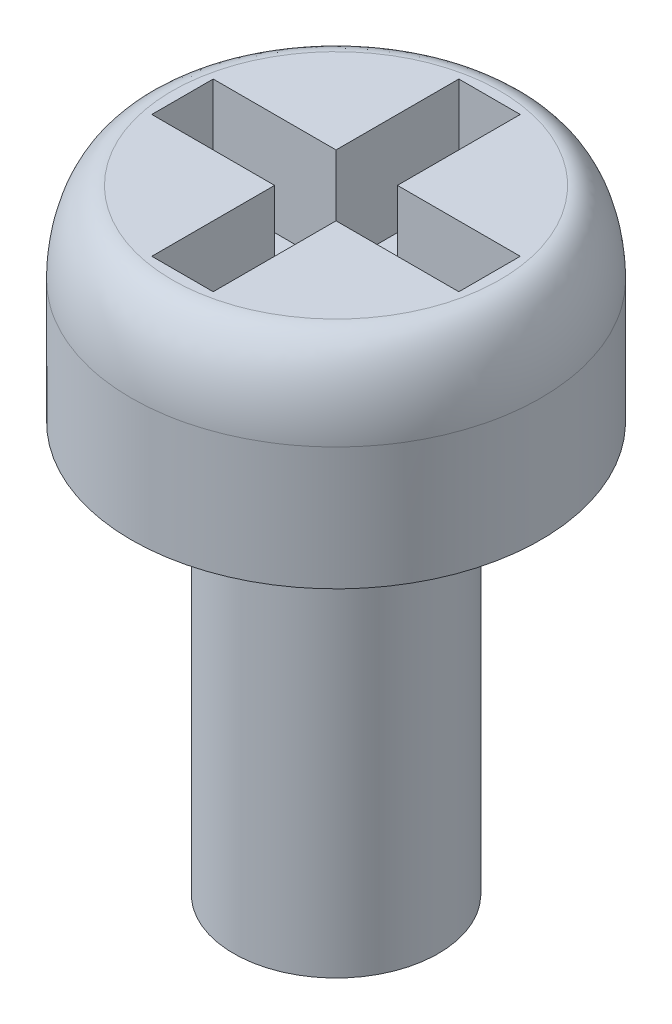
ISO-10303-21;
HEADER;
FILE_DESCRIPTION(('STEP AP214'),'2;1');
FILE_NAME('part.step','',(''),(''),'','','');
FILE_SCHEMA(('AUTOMOTIVE_DESIGN { 1 0 10303 214 1 1 1 1 }'));
ENDSEC;
DATA;
#1=APPLICATION_CONTEXT('core data for automotive mechanical design processes');
#2=APPLICATION_PROTOCOL_DEFINITION('international standard','automotive_design',2000,#1);
#3=PRODUCT_CONTEXT('',#1,'mechanical');
#4=PRODUCT('Part','Part','',(#3));
#5=PRODUCT_RELATED_PRODUCT_CATEGORY('part','',(#4));
#6=PRODUCT_DEFINITION_FORMATION('','',#4);
#7=PRODUCT_DEFINITION_CONTEXT('part definition',#1,'design');
#8=PRODUCT_DEFINITION('design','',#6,#7);
#9=PRODUCT_DEFINITION_SHAPE('','',#8);
#10=(LENGTH_UNIT() NAMED_UNIT(*) SI_UNIT(.MILLI.,.METRE.));
#11=(NAMED_UNIT(*) PLANE_ANGLE_UNIT() SI_UNIT($,.RADIAN.));
#12=(NAMED_UNIT(*) SI_UNIT($,.STERADIAN.) SOLID_ANGLE_UNIT());
#13=UNCERTAINTY_MEASURE_WITH_UNIT(LENGTH_MEASURE(1.E-05),#10,'distance_accuracy_value','');
#14=(GEOMETRIC_REPRESENTATION_CONTEXT(3) GLOBAL_UNCERTAINTY_ASSIGNED_CONTEXT((#13)) GLOBAL_UNIT_ASSIGNED_CONTEXT((#10,
#11,#12)) REPRESENTATION_CONTEXT('',''));
#15=CARTESIAN_POINT('',(0.,0.,0.));
#16=DIRECTION('',(0.,0.,1.));
#17=DIRECTION('',(1.,0.,0.));
#18=AXIS2_PLACEMENT_3D('',#15,#16,#17);
#19=CARTESIAN_POINT('',(0.,3.,0.));
#20=DIRECTION('',(0.,-1.,0.));
#21=DIRECTION('',(0.,0.,-1.));
#22=AXIS2_PLACEMENT_3D('',#19,#20,#21);
#23=CYLINDRICAL_SURFACE('',#22,3.);
#24=CARTESIAN_POINT('',(0.,1.8,3.));
#25=CARTESIAN_POINT('',(0.392699070335841,1.8,3.));
#26=CARTESIAN_POINT('',(0.785243663575687,1.8,2.9219180256566));
#27=CARTESIAN_POINT('',(1.51085693061485,1.8,2.62135916941112));
#28=CARTESIAN_POINT('',(1.84364016795948,1.8,2.3990005191598));
#29=CARTESIAN_POINT('',(2.3990005191598,1.8,1.84364016795948));
#30=CARTESIAN_POINT('',(2.62135916941112,1.8,1.51085693061486));
#31=CARTESIAN_POINT('',(2.9219180256566,1.8,0.785243663575675));
#32=CARTESIAN_POINT('',(3.,1.8,0.392699070335904));
#33=CARTESIAN_POINT('',(3.,1.8,-0.392699070335904));
#34=CARTESIAN_POINT('',(2.92191802565659,1.8,-0.785243663575702));
#35=CARTESIAN_POINT('',(2.62135916941113,1.8,-1.51085693061484));
#36=CARTESIAN_POINT('',(2.39900051915983,1.8,-1.84364016795946));
#37=CARTESIAN_POINT('',(1.84364016795945,1.8,-2.39900051915983));
#38=CARTESIAN_POINT('',(1.51085693061487,1.8,-2.62135916941112));
#39=CARTESIAN_POINT('',(0.785243663575681,1.8,-2.9219180256566));
#40=CARTESIAN_POINT('',(0.392699070335904,1.8,-3.));
#41=CARTESIAN_POINT('',(-0.392699070335903,1.8,-3.));
#42=CARTESIAN_POINT('',(-0.785243663575726,1.8,-2.92191802565658));
#43=CARTESIAN_POINT('',(-1.51085693061481,1.8,-2.62135916941114));
#44=CARTESIAN_POINT('',(-1.84364016795952,1.8,-2.39900051915976));
#45=CARTESIAN_POINT('',(-2.39900051915976,1.8,-1.84364016795952));
#46=CARTESIAN_POINT('',(-2.62135916941112,1.8,-1.51085693061486));
#47=CARTESIAN_POINT('',(-2.9219180256566,1.8,-0.785243663575691));
#48=CARTESIAN_POINT('',(-3.,1.8,-0.392699070335899));
#49=CARTESIAN_POINT('',(-3.,1.8,0.392699070335909));
#50=CARTESIAN_POINT('',(-2.9219180256566,1.8,0.785243663575677));
#51=CARTESIAN_POINT('',(-2.62135916941113,1.8,1.51085693061485));
#52=CARTESIAN_POINT('',(-2.39900051915983,1.8,1.84364016795946));
#53=CARTESIAN_POINT('',(-1.84364016795947,1.8,2.39900051915982));
#54=CARTESIAN_POINT('',(-1.51085693061486,1.8,2.62135916941112));
#55=CARTESIAN_POINT('',(-0.785243663575691,1.8,2.9219180256566));
#56=CARTESIAN_POINT('',(-0.392699070335841,1.8,3.));
#57=CARTESIAN_POINT('',(0.,1.8,3.));
#58=(BOUNDED_CURVE() B_SPLINE_CURVE(3,(#24,#25,#26,#27,#28,#29,#30,#31,#32,#33,#34,#35,#36,#37,
#38,#39,#40,#41,#42,#43,#44,#45,#46,#47,#48,#49,#50,#51,#52,#53,#54,#55,#56,#57),.UNSPECIFIED.,
.T.,.F.) B_SPLINE_CURVE_WITH_KNOTS((4,2,2,2,2,2,2,2,2,2,2,2,2,2,2,2,4),(0.,0.392699081698724,
0.785398163397448,1.17809724509617,1.5707963267949,1.96349540849362,2.35619449019234,
2.74889357189107,3.14159265358979,3.53429173528852,3.92699081698724,4.31968989868597,
4.71238898038469,5.10508806208341,5.49778714378214,5.89048622548086,6.28318530717959),
.UNSPECIFIED.) CURVE() GEOMETRIC_REPRESENTATION_ITEM() RATIONAL_B_SPLINE_CURVE((1.,1.,1.,1.,1.,
1.,1.,1.,1.,1.,1.,1.,1.,1.,1.,1.,1.,1.,1.,1.,1.,1.,1.,1.,1.,1.,1.,1.,1.,1.,1.,1.,1.,1.)) REPRESENTATION_ITEM(''));
#59=CARTESIAN_POINT('',(0.,1.8,3.));
#60=VERTEX_POINT('',#59);
#61=EDGE_CURVE('E12',#60,#60,#58,.F.);
#62=ORIENTED_EDGE('',*,*,#61,.T.);
#63=EDGE_LOOP('',(#62));
#64=FACE_BOUND('',#63,.T.);
#65=CARTESIAN_POINT('',(0.,0.,0.));
#66=DIRECTION('',(0.,1.,0.));
#67=DIRECTION('',(0.,0.,1.));
#68=AXIS2_PLACEMENT_3D('',#65,#66,#67);
#69=CIRCLE('',#68,3.);
#70=CARTESIAN_POINT('',(0.,0.,3.));
#71=VERTEX_POINT('',#70);
#72=EDGE_CURVE('E228',#71,#71,#69,.T.);
#73=ORIENTED_EDGE('',*,*,#72,.T.);
#74=EDGE_LOOP('',(#73));
#75=FACE_BOUND('',#74,.T.);
#76=ADVANCED_FACE('F46',(#64,#75),#23,.T.);
#77=CARTESIAN_POINT('',(0.,3.,0.));
#78=DIRECTION('',(0.,1.,0.));
#79=DIRECTION('',(0.,0.,1.));
#80=AXIS2_PLACEMENT_3D('',#77,#78,#79);
#81=PLANE('',#80);
#82=CARTESIAN_POINT('',(0.,3.,2.4));
#83=CARTESIAN_POINT('',(-0.314159256268673,3.,2.4));
#84=CARTESIAN_POINT('',(-0.628194930860573,3.,2.33753442052533));
#85=CARTESIAN_POINT('',(-1.20868554449186,3.,2.09708733552884));
#86=CARTESIAN_POINT('',(-1.47491213436758,3.,1.91920041532785));
#87=CARTESIAN_POINT('',(-1.91920041532786,3.,1.47491213436757));
#88=CARTESIAN_POINT('',(-2.09708733552891,3.,1.20868554449187));
#89=CARTESIAN_POINT('',(-2.33753442052527,3.,0.628194930860549));
#90=CARTESIAN_POINT('',(-2.4,3.,0.314159256268727));
#91=CARTESIAN_POINT('',(-2.4,3.,-0.314159256268719));
#92=CARTESIAN_POINT('',(-2.33753442052533,3.,-0.62819493086059));
#93=CARTESIAN_POINT('',(-2.09708733552884,3.,-1.20868554449185));
#94=CARTESIAN_POINT('',(-1.91920041532783,3.,-1.47491213436757));
#95=CARTESIAN_POINT('',(-1.47491213436761,3.,-1.91920041532786));
#96=CARTESIAN_POINT('',(-1.20868554449186,3.,-2.0970873355289));
#97=CARTESIAN_POINT('',(-0.62819493086057,3.,-2.33753442052528));
#98=CARTESIAN_POINT('',(-0.314159256268723,3.,-2.4));
#99=CARTESIAN_POINT('',(0.314159256268723,3.,-2.4));
#100=CARTESIAN_POINT('',(0.628194930860559,3.,-2.33753442052527));
#101=CARTESIAN_POINT('',(1.20868554449188,3.,-2.0970873355289));
#102=CARTESIAN_POINT('',(1.47491213436757,3.,-1.91920041532783));
#103=CARTESIAN_POINT('',(1.91920041532786,3.,-1.47491213436761));
#104=CARTESIAN_POINT('',(2.0970873355289,3.,-1.20868554449186));
#105=CARTESIAN_POINT('',(2.33753442052527,3.,-0.628194930860574));
#106=CARTESIAN_POINT('',(2.4,3.,-0.314159256268723));
#107=CARTESIAN_POINT('',(2.4,3.,0.314159256268723));
#108=CARTESIAN_POINT('',(2.33753442052528,3.,0.628194930860572));
#109=CARTESIAN_POINT('',(2.0970873355289,3.,1.20868554449186));
#110=CARTESIAN_POINT('',(1.91920041532785,3.,1.47491213436761));
#111=CARTESIAN_POINT('',(1.47491213436758,3.,1.91920041532782));
#112=CARTESIAN_POINT('',(1.20868554449186,3.,2.09708733552889));
#113=CARTESIAN_POINT('',(0.628194930860568,3.,2.33753442052529));
#114=CARTESIAN_POINT('',(0.314159256268672,3.,2.4));
#115=CARTESIAN_POINT('',(0.,3.,2.4));
#116=(BOUNDED_CURVE() B_SPLINE_CURVE(3,(#82,#83,#84,#85,#86,#87,#88,#89,#90,#91,#92,#93,#94,#95,
#96,#97,#98,#99,#100,#101,#102,#103,#104,#105,#106,#107,#108,#109,#110,#111,#112,#113,#114,
#115),.UNSPECIFIED.,.T.,.F.) B_SPLINE_CURVE_WITH_KNOTS((4,2,2,2,2,2,2,2,2,2,2,2,2,2,2,2,4),(0.,
0.392699081698725,0.785398163397448,1.17809724509617,1.5707963267949,1.96349540849362,
2.35619449019234,2.74889357189107,3.14159265358979,3.53429173528852,3.92699081698724,
4.31968989868597,4.71238898038469,5.10508806208341,5.49778714378214,5.89048622548086,
6.28318530717959),
.UNSPECIFIED.) CURVE() GEOMETRIC_REPRESENTATION_ITEM() RATIONAL_B_SPLINE_CURVE((1.,1.,1.,1.,1.,
1.,1.,1.,1.,1.,1.,1.,1.,1.,1.,1.,1.,1.,1.,1.,1.,1.,1.,1.,1.,1.,1.,1.,1.,1.,1.,1.,1.,1.)) REPRESENTATION_ITEM(''));
#117=CARTESIAN_POINT('',(0.,3.,2.4));
#118=VERTEX_POINT('',#117);
#119=EDGE_CURVE('E60',#118,#118,#116,.F.);
#120=ORIENTED_EDGE('',*,*,#119,.T.);
#121=EDGE_LOOP('',(#120));
#122=FACE_BOUND('',#121,.T.);
#123=DIRECTION('',(0.,0.,-1.));
#124=VECTOR('',#123,1.);
#125=CARTESIAN_POINT('',(0.45,3.,2.25));
#126=LINE('',#125,#124);
#127=CARTESIAN_POINT('',(0.45,3.,2.25));
#128=VERTEX_POINT('',#127);
#129=CARTESIAN_POINT('',(0.45,3.,0.45));
#130=VERTEX_POINT('',#129);
#131=EDGE_CURVE('E67',#128,#130,#126,.T.);
#132=ORIENTED_EDGE('',*,*,#131,.F.);
#133=DIRECTION('',(1.,0.,0.));
#134=VECTOR('',#133,1.);
#135=CARTESIAN_POINT('',(-0.45,3.,2.25));
#136=LINE('',#135,#134);
#137=CARTESIAN_POINT('',(-0.45,3.,2.25));
#138=VERTEX_POINT('',#137);
#139=EDGE_CURVE('E204',#138,#128,#136,.T.);
#140=ORIENTED_EDGE('',*,*,#139,.F.);
#141=DIRECTION('',(0.,0.,1.));
#142=VECTOR('',#141,1.);
#143=CARTESIAN_POINT('',(-0.45,3.,2.25));
#144=LINE('',#143,#142);
#145=CARTESIAN_POINT('',(-0.45,3.,0.45));
#146=VERTEX_POINT('',#145);
#147=EDGE_CURVE('E202',#146,#138,#144,.T.);
#148=ORIENTED_EDGE('',*,*,#147,.F.);
#149=DIRECTION('',(1.,0.,0.));
#150=VECTOR('',#149,1.);
#151=CARTESIAN_POINT('',(-2.25,3.,0.45));
#152=LINE('',#151,#150);
#153=CARTESIAN_POINT('',(-2.25,3.,0.45));
#154=VERTEX_POINT('',#153);
#155=EDGE_CURVE('E151',#154,#146,#152,.T.);
#156=ORIENTED_EDGE('',*,*,#155,.F.);
#157=DIRECTION('',(0.,0.,1.));
#158=VECTOR('',#157,1.);
#159=CARTESIAN_POINT('',(-2.25,3.,-0.45));
#160=LINE('',#159,#158);
#161=CARTESIAN_POINT('',(-2.25,3.,-0.45));
#162=VERTEX_POINT('',#161);
#163=EDGE_CURVE('E198',#162,#154,#160,.T.);
#164=ORIENTED_EDGE('',*,*,#163,.F.);
#165=DIRECTION('',(-1.,0.,0.));
#166=VECTOR('',#165,1.);
#167=CARTESIAN_POINT('',(-2.25,3.,-0.45));
#168=LINE('',#167,#166);
#169=CARTESIAN_POINT('',(-0.45,3.,-0.45));
#170=VERTEX_POINT('',#169);
#171=EDGE_CURVE('E195',#170,#162,#168,.T.);
#172=ORIENTED_EDGE('',*,*,#171,.F.);
#173=DIRECTION('',(0.,0.,1.));
#174=VECTOR('',#173,1.);
#175=CARTESIAN_POINT('',(-0.45,3.,-2.25));
#176=LINE('',#175,#174);
#177=CARTESIAN_POINT('',(-0.45,3.,-2.25));
#178=VERTEX_POINT('',#177);
#179=EDGE_CURVE('E192',#178,#170,#176,.T.);
#180=ORIENTED_EDGE('',*,*,#179,.F.);
#181=DIRECTION('',(-1.,0.,0.));
#182=VECTOR('',#181,1.);
#183=CARTESIAN_POINT('',(-0.45,3.,-2.25));
#184=LINE('',#183,#182);
#185=CARTESIAN_POINT('',(0.45,3.,-2.25));
#186=VERTEX_POINT('',#185);
#187=EDGE_CURVE('E189',#186,#178,#184,.T.);
#188=ORIENTED_EDGE('',*,*,#187,.F.);
#189=DIRECTION('',(0.,0.,-1.));
#190=VECTOR('',#189,1.);
#191=CARTESIAN_POINT('',(0.45,3.,-2.25));
#192=LINE('',#191,#190);
#193=CARTESIAN_POINT('',(0.45,3.,-0.45));
#194=VERTEX_POINT('',#193);
#195=EDGE_CURVE('E186',#194,#186,#192,.T.);
#196=ORIENTED_EDGE('',*,*,#195,.F.);
#197=DIRECTION('',(-1.,0.,0.));
#198=VECTOR('',#197,1.);
#199=CARTESIAN_POINT('',(0.45,3.,-0.45));
#200=LINE('',#199,#198);
#201=CARTESIAN_POINT('',(2.25,3.,-0.45));
#202=VERTEX_POINT('',#201);
#203=EDGE_CURVE('E183',#202,#194,#200,.T.);
#204=ORIENTED_EDGE('',*,*,#203,.F.);
#205=DIRECTION('',(0.,0.,-1.));
#206=VECTOR('',#205,1.);
#207=CARTESIAN_POINT('',(2.25,3.,-0.45));
#208=LINE('',#207,#206);
#209=CARTESIAN_POINT('',(2.25,3.,0.45));
#210=VERTEX_POINT('',#209);
#211=EDGE_CURVE('E180',#210,#202,#208,.T.);
#212=ORIENTED_EDGE('',*,*,#211,.F.);
#213=DIRECTION('',(1.,0.,0.));
#214=VECTOR('',#213,1.);
#215=CARTESIAN_POINT('',(0.45,3.,0.45));
#216=LINE('',#215,#214);
#217=EDGE_CURVE('E177',#130,#210,#216,.T.);
#218=ORIENTED_EDGE('',*,*,#217,.F.);
#219=EDGE_LOOP('',(#132,#140,#148,#156,#164,#172,#180,#188,#196,#204,#212,#218));
#220=FACE_BOUND('',#219,.T.);
#221=ADVANCED_FACE('F243',(#122,#220),#81,.T.);
#222=CARTESIAN_POINT('',(0.,0.,0.));
#223=DIRECTION('',(0.,1.,0.));
#224=DIRECTION('',(0.,0.,1.));
#225=AXIS2_PLACEMENT_3D('',#222,#223,#224);
#226=PLANE('',#225);
#227=CARTESIAN_POINT('',(0.,0.,0.));
#228=DIRECTION('',(0.,-1.,0.));
#229=DIRECTION('',(0.,0.,-1.));
#230=AXIS2_PLACEMENT_3D('',#227,#228,#229);
#231=CIRCLE('',#230,1.5);
#232=CARTESIAN_POINT('',(0.,0.,-1.5));
#233=VERTEX_POINT('',#232);
#234=EDGE_CURVE('E229',#233,#233,#231,.T.);
#235=ORIENTED_EDGE('',*,*,#234,.F.);
#236=EDGE_LOOP('',(#235));
#237=FACE_BOUND('',#236,.T.);
#238=ORIENTED_EDGE('',*,*,#72,.F.);
#239=EDGE_LOOP('',(#238));
#240=FACE_BOUND('',#239,.T.);
#241=ADVANCED_FACE('F253',(#237,#240),#226,.F.);
#242=CARTESIAN_POINT('',(0.,-6.,0.));
#243=DIRECTION('',(0.,1.,0.));
#244=DIRECTION('',(0.,0.,1.));
#245=AXIS2_PLACEMENT_3D('',#242,#243,#244);
#246=CYLINDRICAL_SURFACE('',#245,1.5);
#247=CARTESIAN_POINT('',(0.,-6.,0.));
#248=DIRECTION('',(0.,-1.,0.));
#249=DIRECTION('',(0.,0.,-1.));
#250=AXIS2_PLACEMENT_3D('',#247,#248,#249);
#251=CIRCLE('',#250,1.5);
#252=CARTESIAN_POINT('',(0.,-6.,-1.5));
#253=VERTEX_POINT('',#252);
#254=EDGE_CURVE('E208',#253,#253,#251,.T.);
#255=ORIENTED_EDGE('',*,*,#254,.F.);
#256=EDGE_LOOP('',(#255));
#257=FACE_BOUND('',#256,.T.);
#258=ORIENTED_EDGE('',*,*,#234,.T.);
#259=EDGE_LOOP('',(#258));
#260=FACE_BOUND('',#259,.T.);
#261=ADVANCED_FACE('F254',(#257,#260),#246,.T.);
#262=CARTESIAN_POINT('',(0.,-6.,0.));
#263=DIRECTION('',(0.,-1.,0.));
#264=DIRECTION('',(0.,0.,-1.));
#265=AXIS2_PLACEMENT_3D('',#262,#263,#264);
#266=PLANE('',#265);
#267=ORIENTED_EDGE('',*,*,#254,.T.);
#268=EDGE_LOOP('',(#267));
#269=FACE_BOUND('',#268,.T.);
#270=ADVANCED_FACE('F332',(#269),#266,.T.);
#271=CARTESIAN_POINT('',(0.45,1.5,2.25));
#272=DIRECTION('',(1.,0.,0.));
#273=DIRECTION('',(0.,0.,-1.));
#274=AXIS2_PLACEMENT_3D('',#271,#272,#273);
#275=PLANE('',#274);
#276=ORIENTED_EDGE('',*,*,#131,.T.);
#277=DIRECTION('',(0.,1.,0.));
#278=VECTOR('',#277,1.);
#279=CARTESIAN_POINT('',(0.45,1.5,0.45));
#280=LINE('',#279,#278);
#281=CARTESIAN_POINT('',(0.45,1.5,0.45));
#282=VERTEX_POINT('',#281);
#283=EDGE_CURVE('E115',#282,#130,#280,.T.);
#284=ORIENTED_EDGE('',*,*,#283,.F.);
#285=DIRECTION('',(0.,0.,-1.));
#286=VECTOR('',#285,1.);
#287=CARTESIAN_POINT('',(0.45,1.5,2.25));
#288=LINE('',#287,#286);
#289=CARTESIAN_POINT('',(0.45,1.5,2.25));
#290=VERTEX_POINT('',#289);
#291=EDGE_CURVE('E206',#290,#282,#288,.T.);
#292=ORIENTED_EDGE('',*,*,#291,.F.);
#293=DIRECTION('',(0.,1.,0.));
#294=VECTOR('',#293,1.);
#295=CARTESIAN_POINT('',(0.45,1.5,2.25));
#296=LINE('',#295,#294);
#297=EDGE_CURVE('E75',#290,#128,#296,.T.);
#298=ORIENTED_EDGE('',*,*,#297,.T.);
#299=EDGE_LOOP('',(#276,#284,#292,#298));
#300=FACE_BOUND('',#299,.T.);
#301=ADVANCED_FACE('F299',(#300),#275,.F.);
#302=CARTESIAN_POINT('',(-0.45,1.5,2.25));
#303=DIRECTION('',(0.,0.,1.));
#304=DIRECTION('',(1.,0.,0.));
#305=AXIS2_PLACEMENT_3D('',#302,#303,#304);
#306=PLANE('',#305);
#307=ORIENTED_EDGE('',*,*,#139,.T.);
#308=ORIENTED_EDGE('',*,*,#297,.F.);
#309=DIRECTION('',(1.,0.,0.));
#310=VECTOR('',#309,1.);
#311=CARTESIAN_POINT('',(-0.45,1.5,2.25));
#312=LINE('',#311,#310);
#313=CARTESIAN_POINT('',(-0.45,1.5,2.25));
#314=VERTEX_POINT('',#313);
#315=EDGE_CURVE('E163',#314,#290,#312,.T.);
#316=ORIENTED_EDGE('',*,*,#315,.F.);
#317=DIRECTION('',(0.,1.,0.));
#318=VECTOR('',#317,1.);
#319=CARTESIAN_POINT('',(-0.45,1.5,2.25));
#320=LINE('',#319,#318);
#321=EDGE_CURVE('E155',#314,#138,#320,.T.);
#322=ORIENTED_EDGE('',*,*,#321,.T.);
#323=EDGE_LOOP('',(#307,#308,#316,#322));
#324=FACE_BOUND('',#323,.T.);
#325=ADVANCED_FACE('F296',(#324),#306,.F.);
#326=CARTESIAN_POINT('',(-0.45,1.5,2.25));
#327=DIRECTION('',(-1.,0.,0.));
#328=DIRECTION('',(0.,0.,1.));
#329=AXIS2_PLACEMENT_3D('',#326,#327,#328);
#330=PLANE('',#329);
#331=ORIENTED_EDGE('',*,*,#147,.T.);
#332=ORIENTED_EDGE('',*,*,#321,.F.);
#333=DIRECTION('',(0.,0.,1.));
#334=VECTOR('',#333,1.);
#335=CARTESIAN_POINT('',(-0.45,1.5,2.25));
#336=LINE('',#335,#334);
#337=CARTESIAN_POINT('',(-0.45,1.5,0.45));
#338=VERTEX_POINT('',#337);
#339=EDGE_CURVE('E159',#338,#314,#336,.T.);
#340=ORIENTED_EDGE('',*,*,#339,.F.);
#341=DIRECTION('',(0.,1.,0.));
#342=VECTOR('',#341,1.);
#343=CARTESIAN_POINT('',(-0.45,1.5,0.45));
#344=LINE('',#343,#342);
#345=EDGE_CURVE('E144',#338,#146,#344,.T.);
#346=ORIENTED_EDGE('',*,*,#345,.T.);
#347=EDGE_LOOP('',(#331,#332,#340,#346));
#348=FACE_BOUND('',#347,.T.);
#349=ADVANCED_FACE('F160',(#348),#330,.F.);
#350=CARTESIAN_POINT('',(-2.25,1.5,0.45));
#351=DIRECTION('',(0.,0.,1.));
#352=DIRECTION('',(1.,0.,0.));
#353=AXIS2_PLACEMENT_3D('',#350,#351,#352);
#354=PLANE('',#353);
#355=ORIENTED_EDGE('',*,*,#155,.T.);
#356=ORIENTED_EDGE('',*,*,#345,.F.);
#357=DIRECTION('',(1.,0.,0.));
#358=VECTOR('',#357,1.);
#359=CARTESIAN_POINT('',(-2.25,1.5,0.45));
#360=LINE('',#359,#358);
#361=CARTESIAN_POINT('',(-2.25,1.5,0.45));
#362=VERTEX_POINT('',#361);
#363=EDGE_CURVE('E148',#362,#338,#360,.T.);
#364=ORIENTED_EDGE('',*,*,#363,.F.);
#365=DIRECTION('',(0.,1.,0.));
#366=VECTOR('',#365,1.);
#367=CARTESIAN_POINT('',(-2.25,1.5,0.45));
#368=LINE('',#367,#366);
#369=EDGE_CURVE('E156',#362,#154,#368,.T.);
#370=ORIENTED_EDGE('',*,*,#369,.T.);
#371=EDGE_LOOP('',(#355,#356,#364,#370));
#372=FACE_BOUND('',#371,.T.);
#373=ADVANCED_FACE('F146',(#372),#354,.F.);
#374=CARTESIAN_POINT('',(-2.25,1.5,-0.45));
#375=DIRECTION('',(-1.,0.,0.));
#376=DIRECTION('',(0.,0.,1.));
#377=AXIS2_PLACEMENT_3D('',#374,#375,#376);
#378=PLANE('',#377);
#379=ORIENTED_EDGE('',*,*,#163,.T.);
#380=ORIENTED_EDGE('',*,*,#369,.F.);
#381=DIRECTION('',(0.,0.,1.));
#382=VECTOR('',#381,1.);
#383=CARTESIAN_POINT('',(-2.25,1.5,-0.45));
#384=LINE('',#383,#382);
#385=CARTESIAN_POINT('',(-2.25,1.5,-0.45));
#386=VERTEX_POINT('',#385);
#387=EDGE_CURVE('E169',#386,#362,#384,.T.);
#388=ORIENTED_EDGE('',*,*,#387,.F.);
#389=DIRECTION('',(0.,1.,0.));
#390=VECTOR('',#389,1.);
#391=CARTESIAN_POINT('',(-2.25,1.5,-0.45));
#392=LINE('',#391,#390);
#393=EDGE_CURVE('E211',#386,#162,#392,.T.);
#394=ORIENTED_EDGE('',*,*,#393,.T.);
#395=EDGE_LOOP('',(#379,#380,#388,#394));
#396=FACE_BOUND('',#395,.T.);
#397=ADVANCED_FACE('F304',(#396),#378,.F.);
#398=CARTESIAN_POINT('',(-2.25,1.5,-0.45));
#399=DIRECTION('',(0.,0.,-1.));
#400=DIRECTION('',(-1.,0.,0.));
#401=AXIS2_PLACEMENT_3D('',#398,#399,#400);
#402=PLANE('',#401);
#403=ORIENTED_EDGE('',*,*,#171,.T.);
#404=ORIENTED_EDGE('',*,*,#393,.F.);
#405=DIRECTION('',(-1.,0.,0.));
#406=VECTOR('',#405,1.);
#407=CARTESIAN_POINT('',(-2.25,1.5,-0.45));
#408=LINE('',#407,#406);
#409=CARTESIAN_POINT('',(-0.45,1.5,-0.45));
#410=VERTEX_POINT('',#409);
#411=EDGE_CURVE('E171',#410,#386,#408,.T.);
#412=ORIENTED_EDGE('',*,*,#411,.F.);
#413=DIRECTION('',(0.,1.,0.));
#414=VECTOR('',#413,1.);
#415=CARTESIAN_POINT('',(-0.45,1.5,-0.45));
#416=LINE('',#415,#414);
#417=EDGE_CURVE('E213',#410,#170,#416,.T.);
#418=ORIENTED_EDGE('',*,*,#417,.T.);
#419=EDGE_LOOP('',(#403,#404,#412,#418));
#420=FACE_BOUND('',#419,.T.);
#421=ADVANCED_FACE('F307',(#420),#402,.F.);
#422=CARTESIAN_POINT('',(-0.45,1.5,-2.25));
#423=DIRECTION('',(-1.,0.,0.));
#424=DIRECTION('',(0.,0.,1.));
#425=AXIS2_PLACEMENT_3D('',#422,#423,#424);
#426=PLANE('',#425);
#427=ORIENTED_EDGE('',*,*,#179,.T.);
#428=ORIENTED_EDGE('',*,*,#417,.F.);
#429=DIRECTION('',(0.,0.,1.));
#430=VECTOR('',#429,1.);
#431=CARTESIAN_POINT('',(-0.45,1.5,-2.25));
#432=LINE('',#431,#430);
#433=CARTESIAN_POINT('',(-0.45,1.5,-2.25));
#434=VERTEX_POINT('',#433);
#435=EDGE_CURVE('E476',#434,#410,#432,.T.);
#436=ORIENTED_EDGE('',*,*,#435,.F.);
#437=DIRECTION('',(0.,1.,0.));
#438=VECTOR('',#437,1.);
#439=CARTESIAN_POINT('',(-0.45,1.5,-2.25));
#440=LINE('',#439,#438);
#441=EDGE_CURVE('E215',#434,#178,#440,.T.);
#442=ORIENTED_EDGE('',*,*,#441,.T.);
#443=EDGE_LOOP('',(#427,#428,#436,#442));
#444=FACE_BOUND('',#443,.T.);
#445=ADVANCED_FACE('F311',(#444),#426,.F.);
#446=CARTESIAN_POINT('',(-0.45,1.5,-2.25));
#447=DIRECTION('',(0.,0.,-1.));
#448=DIRECTION('',(-1.,0.,0.));
#449=AXIS2_PLACEMENT_3D('',#446,#447,#448);
#450=PLANE('',#449);
#451=ORIENTED_EDGE('',*,*,#187,.T.);
#452=ORIENTED_EDGE('',*,*,#441,.F.);
#453=DIRECTION('',(-1.,0.,0.));
#454=VECTOR('',#453,1.);
#455=CARTESIAN_POINT('',(-0.45,1.5,-2.25));
#456=LINE('',#455,#454);
#457=CARTESIAN_POINT('',(0.45,1.5,-2.25));
#458=VERTEX_POINT('',#457);
#459=EDGE_CURVE('E473',#458,#434,#456,.T.);
#460=ORIENTED_EDGE('',*,*,#459,.F.);
#461=DIRECTION('',(0.,1.,0.));
#462=VECTOR('',#461,1.);
#463=CARTESIAN_POINT('',(0.45,1.5,-2.25));
#464=LINE('',#463,#462);
#465=EDGE_CURVE('E217',#458,#186,#464,.T.);
#466=ORIENTED_EDGE('',*,*,#465,.T.);
#467=EDGE_LOOP('',(#451,#452,#460,#466));
#468=FACE_BOUND('',#467,.T.);
#469=ADVANCED_FACE('F315',(#468),#450,.F.);
#470=CARTESIAN_POINT('',(0.45,1.5,-2.25));
#471=DIRECTION('',(1.,0.,0.));
#472=DIRECTION('',(0.,0.,-1.));
#473=AXIS2_PLACEMENT_3D('',#470,#471,#472);
#474=PLANE('',#473);
#475=ORIENTED_EDGE('',*,*,#195,.T.);
#476=ORIENTED_EDGE('',*,*,#465,.F.);
#477=DIRECTION('',(0.,0.,-1.));
#478=VECTOR('',#477,1.);
#479=CARTESIAN_POINT('',(0.45,1.5,-2.25));
#480=LINE('',#479,#478);
#481=CARTESIAN_POINT('',(0.45,1.5,-0.45));
#482=VERTEX_POINT('',#481);
#483=EDGE_CURVE('E463',#482,#458,#480,.T.);
#484=ORIENTED_EDGE('',*,*,#483,.F.);
#485=DIRECTION('',(0.,1.,0.));
#486=VECTOR('',#485,1.);
#487=CARTESIAN_POINT('',(0.45,1.5,-0.45));
#488=LINE('',#487,#486);
#489=EDGE_CURVE('E219',#482,#194,#488,.T.);
#490=ORIENTED_EDGE('',*,*,#489,.T.);
#491=EDGE_LOOP('',(#475,#476,#484,#490));
#492=FACE_BOUND('',#491,.T.);
#493=ADVANCED_FACE('F319',(#492),#474,.F.);
#494=CARTESIAN_POINT('',(0.45,1.5,-0.45));
#495=DIRECTION('',(0.,0.,-1.));
#496=DIRECTION('',(-1.,0.,0.));
#497=AXIS2_PLACEMENT_3D('',#494,#495,#496);
#498=PLANE('',#497);
#499=ORIENTED_EDGE('',*,*,#203,.T.);
#500=ORIENTED_EDGE('',*,*,#489,.F.);
#501=DIRECTION('',(-1.,0.,0.));
#502=VECTOR('',#501,1.);
#503=CARTESIAN_POINT('',(0.45,1.5,-0.45));
#504=LINE('',#503,#502);
#505=CARTESIAN_POINT('',(2.25,1.5,-0.45));
#506=VERTEX_POINT('',#505);
#507=EDGE_CURVE('E460',#506,#482,#504,.T.);
#508=ORIENTED_EDGE('',*,*,#507,.F.);
#509=DIRECTION('',(0.,1.,0.));
#510=VECTOR('',#509,1.);
#511=CARTESIAN_POINT('',(2.25,1.5,-0.45));
#512=LINE('',#511,#510);
#513=EDGE_CURVE('E221',#506,#202,#512,.T.);
#514=ORIENTED_EDGE('',*,*,#513,.T.);
#515=EDGE_LOOP('',(#499,#500,#508,#514));
#516=FACE_BOUND('',#515,.T.);
#517=ADVANCED_FACE('F323',(#516),#498,.F.);
#518=CARTESIAN_POINT('',(2.25,1.5,-0.45));
#519=DIRECTION('',(1.,0.,0.));
#520=DIRECTION('',(0.,0.,-1.));
#521=AXIS2_PLACEMENT_3D('',#518,#519,#520);
#522=PLANE('',#521);
#523=ORIENTED_EDGE('',*,*,#211,.T.);
#524=ORIENTED_EDGE('',*,*,#513,.F.);
#525=DIRECTION('',(0.,0.,-1.));
#526=VECTOR('',#525,1.);
#527=CARTESIAN_POINT('',(2.25,1.5,-0.45));
#528=LINE('',#527,#526);
#529=CARTESIAN_POINT('',(2.25,1.5,0.45));
#530=VERTEX_POINT('',#529);
#531=EDGE_CURVE('E464',#530,#506,#528,.T.);
#532=ORIENTED_EDGE('',*,*,#531,.F.);
#533=DIRECTION('',(0.,1.,0.));
#534=VECTOR('',#533,1.);
#535=CARTESIAN_POINT('',(2.25,1.5,0.45));
#536=LINE('',#535,#534);
#537=EDGE_CURVE('E223',#530,#210,#536,.T.);
#538=ORIENTED_EDGE('',*,*,#537,.T.);
#539=EDGE_LOOP('',(#523,#524,#532,#538));
#540=FACE_BOUND('',#539,.T.);
#541=ADVANCED_FACE('F292',(#540),#522,.F.);
#542=CARTESIAN_POINT('',(0.45,1.5,0.45));
#543=DIRECTION('',(0.,0.,1.));
#544=DIRECTION('',(1.,0.,0.));
#545=AXIS2_PLACEMENT_3D('',#542,#543,#544);
#546=PLANE('',#545);
#547=ORIENTED_EDGE('',*,*,#217,.T.);
#548=ORIENTED_EDGE('',*,*,#537,.F.);
#549=DIRECTION('',(1.,0.,0.));
#550=VECTOR('',#549,1.);
#551=CARTESIAN_POINT('',(0.45,1.5,0.45));
#552=LINE('',#551,#550);
#553=EDGE_CURVE('E467',#282,#530,#552,.T.);
#554=ORIENTED_EDGE('',*,*,#553,.F.);
#555=ORIENTED_EDGE('',*,*,#283,.T.);
#556=EDGE_LOOP('',(#547,#548,#554,#555));
#557=FACE_BOUND('',#556,.T.);
#558=ADVANCED_FACE('F287',(#557),#546,.F.);
#559=CARTESIAN_POINT('',(0.,1.5,0.));
#560=DIRECTION('',(0.,-1.,0.));
#561=DIRECTION('',(0.,0.,-1.));
#562=AXIS2_PLACEMENT_3D('',#559,#560,#561);
#563=PLANE('',#562);
#564=ORIENTED_EDGE('',*,*,#291,.T.);
#565=ORIENTED_EDGE('',*,*,#553,.T.);
#566=ORIENTED_EDGE('',*,*,#531,.T.);
#567=ORIENTED_EDGE('',*,*,#507,.T.);
#568=ORIENTED_EDGE('',*,*,#483,.T.);
#569=ORIENTED_EDGE('',*,*,#459,.T.);
#570=ORIENTED_EDGE('',*,*,#435,.T.);
#571=ORIENTED_EDGE('',*,*,#411,.T.);
#572=ORIENTED_EDGE('',*,*,#387,.T.);
#573=ORIENTED_EDGE('',*,*,#363,.T.);
#574=ORIENTED_EDGE('',*,*,#339,.T.);
#575=ORIENTED_EDGE('',*,*,#315,.T.);
#576=EDGE_LOOP('',(#564,#565,#566,#567,#568,#569,#570,#571,#572,#573,#574,#575));
#577=FACE_BOUND('',#576,.T.);
#578=ADVANCED_FACE('F166',(#577),#563,.F.);
#579=CARTESIAN_POINT('',(0.,3.,2.4));
#580=CARTESIAN_POINT('',(0.314159256268672,3.,2.4));
#581=CARTESIAN_POINT('',(0.628194930860568,3.,2.33753442052529));
#582=CARTESIAN_POINT('',(1.20868554449186,3.,2.09708733552889));
#583=CARTESIAN_POINT('',(1.47491213436758,3.,1.91920041532782));
#584=CARTESIAN_POINT('',(1.91920041532785,3.,1.47491213436761));
#585=CARTESIAN_POINT('',(2.0970873355289,3.,1.20868554449186));
#586=CARTESIAN_POINT('',(2.33753442052528,3.,0.628194930860572));
#587=CARTESIAN_POINT('',(2.4,3.,0.314159256268723));
#588=CARTESIAN_POINT('',(2.4,3.,-0.314159256268723));
#589=CARTESIAN_POINT('',(2.33753442052527,3.,-0.628194930860574));
#590=CARTESIAN_POINT('',(2.0970873355289,3.,-1.20868554449186));
#591=CARTESIAN_POINT('',(1.91920041532786,3.,-1.47491213436761));
#592=CARTESIAN_POINT('',(1.47491213436757,3.,-1.91920041532783));
#593=CARTESIAN_POINT('',(1.20868554449188,3.,-2.0970873355289));
#594=CARTESIAN_POINT('',(0.628194930860559,3.,-2.33753442052527));
#595=CARTESIAN_POINT('',(0.314159256268723,3.,-2.4));
#596=CARTESIAN_POINT('',(-0.314159256268723,3.,-2.4));
#597=CARTESIAN_POINT('',(-0.62819493086057,3.,-2.33753442052528));
#598=CARTESIAN_POINT('',(-1.20868554449186,3.,-2.0970873355289));
#599=CARTESIAN_POINT('',(-1.47491213436761,3.,-1.91920041532786));
#600=CARTESIAN_POINT('',(-1.91920041532783,3.,-1.47491213436757));
#601=CARTESIAN_POINT('',(-2.09708733552884,3.,-1.20868554449185));
#602=CARTESIAN_POINT('',(-2.33753442052533,3.,-0.62819493086059));
#603=CARTESIAN_POINT('',(-2.4,3.,-0.314159256268719));
#604=CARTESIAN_POINT('',(-2.4,3.,0.314159256268727));
#605=CARTESIAN_POINT('',(-2.33753442052527,3.,0.628194930860549));
#606=CARTESIAN_POINT('',(-2.09708733552891,3.,1.20868554449187));
#607=CARTESIAN_POINT('',(-1.91920041532786,3.,1.47491213436757));
#608=CARTESIAN_POINT('',(-1.47491213436758,3.,1.91920041532785));
#609=CARTESIAN_POINT('',(-1.20868554449186,3.,2.09708733552884));
#610=CARTESIAN_POINT('',(-0.628194930860573,3.,2.33753442052533));
#611=CARTESIAN_POINT('',(-0.314159256268673,3.,2.4));
#612=CARTESIAN_POINT('',(0.,3.,2.4));
#613=CARTESIAN_POINT('',(0.,3.,3.));
#614=CARTESIAN_POINT('',(0.392699070335841,2.99999999999986,2.99999999999993));
#615=CARTESIAN_POINT('',(0.785243663575715,3.,2.92191802565666));
#616=CARTESIAN_POINT('',(1.51085693061482,3.,2.62135916941106));
#617=CARTESIAN_POINT('',(1.84364016795945,3.,2.3990005191597));
#618=CARTESIAN_POINT('',(2.39900051915984,3.,1.84364016795958));
#619=CARTESIAN_POINT('',(2.62135916941108,3.,1.51085693061484));
#620=CARTESIAN_POINT('',(2.92191802565665,3.,0.785243663575694));
#621=CARTESIAN_POINT('',(3.,3.,0.392699070335904));
#622=CARTESIAN_POINT('',(3.,3.,-0.392699070335904));
#623=CARTESIAN_POINT('',(2.92191802565658,3.,-0.785243663575696));
#624=CARTESIAN_POINT('',(2.62135916941115,3.,-1.51085693061485));
#625=CARTESIAN_POINT('',(2.39900051915983,3.,-1.84364016795946));
#626=CARTESIAN_POINT('',(1.84364016795945,3.,-2.39900051915983));
#627=CARTESIAN_POINT('',(1.51085693061485,3.,-2.62135916941108));
#628=CARTESIAN_POINT('',(0.785243663575699,3.,-2.92191802565664));
#629=CARTESIAN_POINT('',(0.392699070335904,3.,-3.));
#630=CARTESIAN_POINT('',(-0.392699070335903,3.,-3.));
#631=CARTESIAN_POINT('',(-0.785243663575725,3.,-2.92191802565658));
#632=CARTESIAN_POINT('',(-1.51085693061481,3.,-2.62135916941115));
#633=CARTESIAN_POINT('',(-1.84364016795959,3.,-2.39900051915983));
#634=CARTESIAN_POINT('',(-2.3990005191597,3.,-1.84364016795945));
#635=CARTESIAN_POINT('',(-2.62135916941105,3.,-1.51085693061479));
#636=CARTESIAN_POINT('',(-2.92191802565667,3.,-0.785243663575754));
#637=CARTESIAN_POINT('',(-3.,3.,-0.392699070335899));
#638=CARTESIAN_POINT('',(-3.,3.,0.392699070335909));
#639=CARTESIAN_POINT('',(-2.9219180256566,3.,0.785243663575678));
#640=CARTESIAN_POINT('',(-2.62135916941112,3.,1.51085693061485));
#641=CARTESIAN_POINT('',(-2.39900051915986,3.,1.84364016795949));
#642=CARTESIAN_POINT('',(-1.84364016795944,3.,2.39900051915978));
#643=CARTESIAN_POINT('',(-1.51085693061483,2.99999999999993,2.62135916941105));
#644=CARTESIAN_POINT('',(-0.785243663575721,3.00000000000007,2.92191802565667));
#645=CARTESIAN_POINT('',(-0.392699070335841,3.00000000000014,3.00000000000007));
#646=CARTESIAN_POINT('',(0.,3.,3.));
#647=CARTESIAN_POINT('',(0.,1.8,3.));
#648=CARTESIAN_POINT('',(0.392699070335841,1.8,3.));
#649=CARTESIAN_POINT('',(0.785243663575687,1.8,2.9219180256566));
#650=CARTESIAN_POINT('',(1.51085693061485,1.8,2.62135916941112));
#651=CARTESIAN_POINT('',(1.84364016795948,1.8,2.3990005191598));
#652=CARTESIAN_POINT('',(2.3990005191598,1.8,1.84364016795948));
#653=CARTESIAN_POINT('',(2.62135916941112,1.8,1.51085693061486));
#654=CARTESIAN_POINT('',(2.9219180256566,1.8,0.785243663575675));
#655=CARTESIAN_POINT('',(3.,1.8,0.392699070335904));
#656=CARTESIAN_POINT('',(3.,1.8,-0.392699070335904));
#657=CARTESIAN_POINT('',(2.92191802565659,1.8,-0.785243663575702));
#658=CARTESIAN_POINT('',(2.62135916941113,1.8,-1.51085693061484));
#659=CARTESIAN_POINT('',(2.39900051915983,1.8,-1.84364016795946));
#660=CARTESIAN_POINT('',(1.84364016795945,1.8,-2.39900051915983));
#661=CARTESIAN_POINT('',(1.51085693061487,1.8,-2.62135916941112));
#662=CARTESIAN_POINT('',(0.785243663575681,1.8,-2.9219180256566));
#663=CARTESIAN_POINT('',(0.392699070335904,1.8,-3.));
#664=CARTESIAN_POINT('',(-0.392699070335903,1.8,-3.));
#665=CARTESIAN_POINT('',(-0.785243663575726,1.8,-2.92191802565658));
#666=CARTESIAN_POINT('',(-1.51085693061481,1.8,-2.62135916941114));
#667=CARTESIAN_POINT('',(-1.84364016795952,1.8,-2.39900051915976));
#668=CARTESIAN_POINT('',(-2.39900051915976,1.8,-1.84364016795952));
#669=CARTESIAN_POINT('',(-2.62135916941112,1.8,-1.51085693061486));
#670=CARTESIAN_POINT('',(-2.9219180256566,1.8,-0.785243663575691));
#671=CARTESIAN_POINT('',(-3.,1.8,-0.392699070335899));
#672=CARTESIAN_POINT('',(-3.,1.8,0.392699070335909));
#673=CARTESIAN_POINT('',(-2.9219180256566,1.8,0.785243663575677));
#674=CARTESIAN_POINT('',(-2.62135916941113,1.8,1.51085693061485));
#675=CARTESIAN_POINT('',(-2.39900051915983,1.8,1.84364016795946));
#676=CARTESIAN_POINT('',(-1.84364016795947,1.8,2.39900051915982));
#677=CARTESIAN_POINT('',(-1.51085693061486,1.8,2.62135916941112));
#678=CARTESIAN_POINT('',(-0.785243663575691,1.8,2.9219180256566));
#679=CARTESIAN_POINT('',(-0.392699070335841,1.8,3.));
#680=CARTESIAN_POINT('',(0.,1.8,3.));
#681=(BOUNDED_SURFACE() B_SPLINE_SURFACE(2,3,((#579,#580,#581,#582,#583,#584,#585,#586,#587,
#588,#589,#590,#591,#592,#593,#594,#595,#596,#597,#598,#599,#600,#601,#602,#603,#604,#605,#606,
#607,#608,#609,#610,#611,#612),(#613,#614,#615,#616,#617,#618,#619,#620,#621,#622,#623,#624,
#625,#626,#627,#628,#629,#630,#631,#632,#633,#634,#635,#636,#637,#638,#639,#640,#641,#642,#643,
#644,#645,#646),(#647,#648,#649,#650,#651,#652,#653,#654,#655,#656,#657,#658,#659,#660,#661,
#662,#663,#664,#665,#666,#667,#668,#669,#670,#671,#672,#673,#674,#675,#676,#677,#678,#679,
#680)),.UNSPECIFIED.,.F.,.T.,.F.) B_SPLINE_SURFACE_WITH_KNOTS((3,3),(4,2,2,2,2,2,2,2,2,2,2,2,2,
2,2,2,4),(0.,1.),(0.,0.392699081698724,0.785398163397448,1.17809724509617,1.5707963267949,
1.96349540849362,2.35619449019234,2.74889357189107,3.14159265358979,3.53429173528852,
3.92699081698724,4.31968989868597,4.71238898038469,5.10508806208341,5.49778714378214,
5.89048622548086,6.28318530717959),
.UNSPECIFIED.) GEOMETRIC_REPRESENTATION_ITEM() RATIONAL_B_SPLINE_SURFACE(((1.,1.,1.,1.,1.,1.,1.,
1.,1.,1.,1.,1.,1.,1.,1.,1.,1.,1.,1.,1.,1.,1.,1.,1.,1.,1.,1.,1.,1.,1.,1.,1.,1.,1.),
(0.707106781186548,0.707106781186548,0.707106781186548,0.707106781186548,0.707106781186548,
0.707106781186548,0.707106781186548,0.707106781186548,0.707106781186548,0.707106781186548,
0.707106781186548,0.707106781186548,0.707106781186548,0.707106781186548,0.707106781186548,
0.707106781186548,0.707106781186548,0.707106781186548,0.707106781186548,0.707106781186548,
0.707106781186547,0.707106781186547,0.707106781186548,0.707106781186548,0.707106781186548,
0.707106781186548,0.707106781186548,0.707106781186548,0.707106781186548,0.707106781186548,
0.707106781186548,0.707106781186548,0.707106781186548,0.707106781186548),(1.,1.,1.,1.,1.,1.,1.,
1.,1.,1.,1.,1.,1.,1.,1.,1.,1.,1.,1.,1.,1.,1.,1.,1.,1.,1.,1.,1.,1.,1.,1.,1.,1.,1.))) REPRESENTATION_ITEM('') SURFACE());
#682=ORIENTED_EDGE('',*,*,#61,.F.);
#683=EDGE_LOOP('',(#682));
#684=FACE_BOUND('',#683,.T.);
#685=ORIENTED_EDGE('',*,*,#119,.F.);
#686=EDGE_LOOP('',(#685));
#687=FACE_BOUND('',#686,.T.);
#688=ADVANCED_FACE('F49',(#684,#687),#681,.T.);
#689=CLOSED_SHELL('',(#76,#221,#241,#261,#270,#301,#325,#349,#373,#397,#421,#445,#469,#493,#517,
#541,#558,#578,#688));
#690=MANIFOLD_SOLID_BREP('B2',#689);
#691=ADVANCED_BREP_SHAPE_REPRESENTATION('',(#18,#690),#14);
#692=SHAPE_DEFINITION_REPRESENTATION(#9,#691);
ENDSEC;
END-ISO-10303-21;
